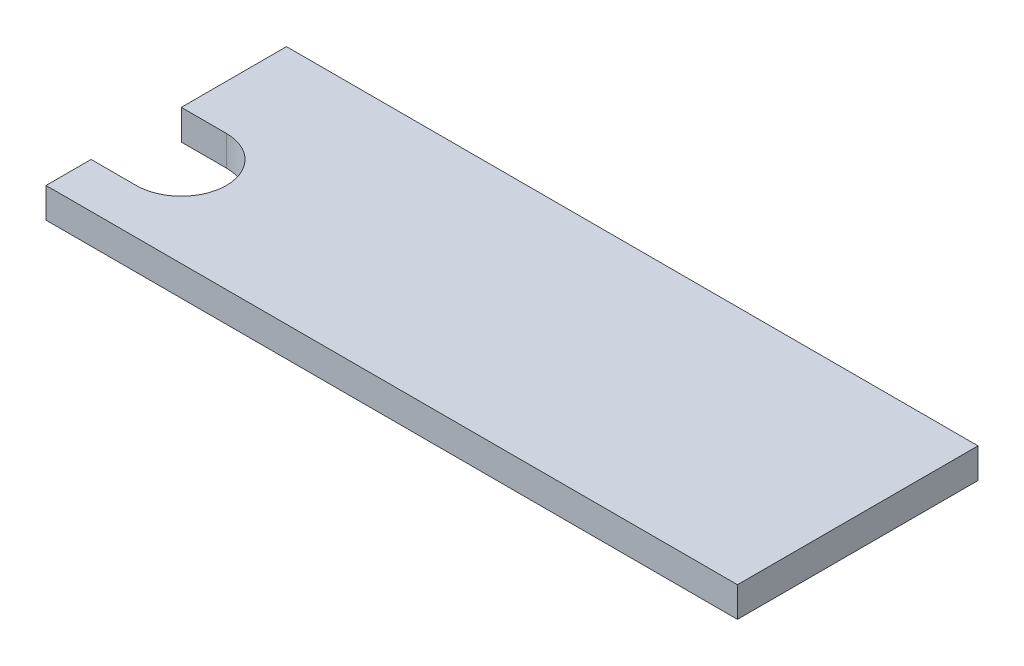
ISO-10303-21;
HEADER;
FILE_DESCRIPTION(('STEP AP214'),'2;1');
FILE_NAME('part.step','',(''),(''),'','','');
FILE_SCHEMA(('AUTOMOTIVE_DESIGN { 1 0 10303 214 1 1 1 1 }'));
ENDSEC;
DATA;
#1=APPLICATION_CONTEXT('core data for automotive mechanical design processes');
#2=APPLICATION_PROTOCOL_DEFINITION('international standard','automotive_design',2000,#1);
#3=PRODUCT_CONTEXT('',#1,'mechanical');
#4=PRODUCT('Part','Part','',(#3));
#5=PRODUCT_RELATED_PRODUCT_CATEGORY('part','',(#4));
#6=PRODUCT_DEFINITION_FORMATION('','',#4);
#7=PRODUCT_DEFINITION_CONTEXT('part definition',#1,'design');
#8=PRODUCT_DEFINITION('design','',#6,#7);
#9=PRODUCT_DEFINITION_SHAPE('','',#8);
#10=(LENGTH_UNIT() NAMED_UNIT(*) SI_UNIT(.MILLI.,.METRE.));
#11=(NAMED_UNIT(*) PLANE_ANGLE_UNIT() SI_UNIT($,.RADIAN.));
#12=(NAMED_UNIT(*) SI_UNIT($,.STERADIAN.) SOLID_ANGLE_UNIT());
#13=UNCERTAINTY_MEASURE_WITH_UNIT(LENGTH_MEASURE(1.E-05),#10,'distance_accuracy_value','');
#14=(GEOMETRIC_REPRESENTATION_CONTEXT(3) GLOBAL_UNCERTAINTY_ASSIGNED_CONTEXT((#13)) GLOBAL_UNIT_ASSIGNED_CONTEXT((#10,
#11,#12)) REPRESENTATION_CONTEXT('',''));
#15=CARTESIAN_POINT('',(0.,0.,0.));
#16=DIRECTION('',(0.,0.,1.));
#17=DIRECTION('',(1.,0.,0.));
#18=AXIS2_PLACEMENT_3D('',#15,#16,#17);
#19=CARTESIAN_POINT('',(-115.,0.,-3.88578058618805E-13));
#20=DIRECTION('',(-1.,0.,0.));
#21=DIRECTION('',(0.,0.,1.));
#22=AXIS2_PLACEMENT_3D('',#19,#20,#21);
#23=PLANE('',#22);
#24=DIRECTION('',(0.,1.,0.));
#25=VECTOR('',#24,1.);
#26=CARTESIAN_POINT('',(-115.,-5.00099999999959,-5.0000000000005));
#27=LINE('',#26,#25);
#28=CARTESIAN_POINT('',(-115.,-4.99999999999901,-5.0000000000005));
#29=VERTEX_POINT('',#28);
#30=CARTESIAN_POINT('',(-115.,5.00000000000039,-5.0000000000005));
#31=VERTEX_POINT('',#30);
#32=EDGE_CURVE('E111',#29,#31,#27,.T.);
#33=ORIENTED_EDGE('',*,*,#32,.T.);
#34=DIRECTION('',(0.,0.,1.));
#35=VECTOR('',#34,1.);
#36=CARTESIAN_POINT('',(-115.,5.00000000000039,-40.0000000000004));
#37=LINE('',#36,#35);
#38=CARTESIAN_POINT('',(-115.,5.00000000000039,-40.0000000000004));
#39=VERTEX_POINT('',#38);
#40=EDGE_CURVE('E134',#39,#31,#37,.T.);
#41=ORIENTED_EDGE('',*,*,#40,.F.);
#42=DIRECTION('',(0.,1.,0.));
#43=VECTOR('',#42,1.);
#44=CARTESIAN_POINT('',(-115.,5.00000000000039,-40.0000000000004));
#45=LINE('',#44,#43);
#46=CARTESIAN_POINT('',(-115.,-4.99999999999901,-40.0000000000004));
#47=VERTEX_POINT('',#46);
#48=EDGE_CURVE('E128',#47,#39,#45,.T.);
#49=ORIENTED_EDGE('',*,*,#48,.F.);
#50=DIRECTION('',(0.,0.,-1.));
#51=VECTOR('',#50,1.);
#52=CARTESIAN_POINT('',(-115.,-4.99999999999901,-40.0000000000004));
#53=LINE('',#52,#51);
#54=EDGE_CURVE('E82',#29,#47,#53,.T.);
#55=ORIENTED_EDGE('',*,*,#54,.F.);
#56=EDGE_LOOP('',(#33,#41,#49,#55));
#57=FACE_BOUND('',#56,.T.);
#58=ADVANCED_FACE('F36',(#57),#23,.T.);
#59=CARTESIAN_POINT('',(115.,5.00000000000034,-40.));
#60=DIRECTION('',(0.,0.,1.));
#61=DIRECTION('',(1.,0.,0.));
#62=AXIS2_PLACEMENT_3D('',#59,#60,#61);
#63=PLANE('',#62);
#64=ORIENTED_EDGE('',*,*,#48,.T.);
#65=DIRECTION('',(-1.,0.,0.));
#66=VECTOR('',#65,1.);
#67=CARTESIAN_POINT('',(115.,5.00000000000034,-40.));
#68=LINE('',#67,#66);
#69=CARTESIAN_POINT('',(115.,5.00000000000034,-40.));
#70=VERTEX_POINT('',#69);
#71=EDGE_CURVE('E12',#70,#39,#68,.T.);
#72=ORIENTED_EDGE('',*,*,#71,.F.);
#73=DIRECTION('',(0.,1.,0.));
#74=VECTOR('',#73,1.);
#75=CARTESIAN_POINT('',(115.,5.00000000000034,-40.));
#76=LINE('',#75,#74);
#77=CARTESIAN_POINT('',(115.,-4.99999999999939,-40.));
#78=VERTEX_POINT('',#77);
#79=EDGE_CURVE('E133',#78,#70,#76,.T.);
#80=ORIENTED_EDGE('',*,*,#79,.F.);
#81=DIRECTION('',(-1.,0.,0.));
#82=VECTOR('',#81,1.);
#83=CARTESIAN_POINT('',(115.,-4.99999999999939,-40.));
#84=LINE('',#83,#82);
#85=EDGE_CURVE('E138',#78,#47,#84,.T.);
#86=ORIENTED_EDGE('',*,*,#85,.T.);
#87=EDGE_LOOP('',(#64,#72,#80,#86));
#88=FACE_BOUND('',#87,.T.);
#89=ADVANCED_FACE('F38',(#88),#63,.F.);
#90=CARTESIAN_POINT('',(115.,5.00000000000034,-40.));
#91=DIRECTION('',(0.,-1.,0.));
#92=DIRECTION('',(0.,0.,-1.));
#93=AXIS2_PLACEMENT_3D('',#90,#91,#92);
#94=PLANE('',#93);
#95=ORIENTED_EDGE('',*,*,#40,.T.);
#96=DIRECTION('',(-1.,0.,0.));
#97=VECTOR('',#96,1.);
#98=CARTESIAN_POINT('',(-129.999999999999,5.00000000000167,-5.0000000000005));
#99=LINE('',#98,#97);
#100=CARTESIAN_POINT('',(-99.9999999999996,4.99999999999989,-5.0000000000005));
#101=VERTEX_POINT('',#100);
#102=EDGE_CURVE('E116',#101,#31,#99,.T.);
#103=ORIENTED_EDGE('',*,*,#102,.F.);
#104=CARTESIAN_POINT('',(-99.9999999999996,4.99999999999989,9.99999999999962));
#105=DIRECTION('',(0.,1.,0.));
#106=DIRECTION('',(0.,0.,1.));
#107=AXIS2_PLACEMENT_3D('',#104,#105,#106);
#108=CIRCLE('',#107,15.);
#109=CARTESIAN_POINT('',(-100.,5.00000000000034,24.9999999999995));
#110=VERTEX_POINT('',#109);
#111=EDGE_CURVE('E166',#110,#101,#108,.T.);
#112=ORIENTED_EDGE('',*,*,#111,.F.);
#113=DIRECTION('',(1.,0.,0.));
#114=VECTOR('',#113,1.);
#115=CARTESIAN_POINT('',(-129.999999999999,5.00000000000167,24.9999999999995));
#116=LINE('',#115,#114);
#117=CARTESIAN_POINT('',(-115.,5.00000000000078,24.9999999999995));
#118=VERTEX_POINT('',#117);
#119=EDGE_CURVE('E124',#118,#110,#116,.T.);
#120=ORIENTED_EDGE('',*,*,#119,.F.);
#121=CARTESIAN_POINT('',(-115.,5.00000000000078,39.9999999999996));
#122=VERTEX_POINT('',#121);
#123=EDGE_CURVE('E155',#118,#122,#37,.T.);
#124=ORIENTED_EDGE('',*,*,#123,.T.);
#125=DIRECTION('',(-1.,0.,0.));
#126=VECTOR('',#125,1.);
#127=CARTESIAN_POINT('',(115.,5.00000000000028,40.));
#128=LINE('',#127,#126);
#129=CARTESIAN_POINT('',(115.,5.00000000000028,40.));
#130=VERTEX_POINT('',#129);
#131=EDGE_CURVE('E45',#130,#122,#128,.T.);
#132=ORIENTED_EDGE('',*,*,#131,.F.);
#133=DIRECTION('',(0.,0.,1.));
#134=VECTOR('',#133,1.);
#135=CARTESIAN_POINT('',(115.,5.00000000000034,-40.));
#136=LINE('',#135,#134);
#137=EDGE_CURVE('E89',#70,#130,#136,.T.);
#138=ORIENTED_EDGE('',*,*,#137,.F.);
#139=ORIENTED_EDGE('',*,*,#71,.T.);
#140=EDGE_LOOP('',(#95,#103,#112,#120,#124,#132,#138,#139));
#141=FACE_BOUND('',#140,.T.);
#142=ADVANCED_FACE('F179',(#141),#94,.F.);
#143=CARTESIAN_POINT('',(115.,-4.99999999999945,40.));
#144=DIRECTION('',(0.,0.,-1.));
#145=DIRECTION('',(-1.,0.,0.));
#146=AXIS2_PLACEMENT_3D('',#143,#144,#145);
#147=PLANE('',#146);
#148=DIRECTION('',(0.,-1.,0.));
#149=VECTOR('',#148,1.);
#150=CARTESIAN_POINT('',(-115.,-4.99999999999851,39.9999999999996));
#151=LINE('',#150,#149);
#152=CARTESIAN_POINT('',(-115.,-4.99999999999851,39.9999999999996));
#153=VERTEX_POINT('',#152);
#154=EDGE_CURVE('E130',#122,#153,#151,.T.);
#155=ORIENTED_EDGE('',*,*,#154,.T.);
#156=DIRECTION('',(-1.,0.,0.));
#157=VECTOR('',#156,1.);
#158=CARTESIAN_POINT('',(115.,-4.99999999999945,40.));
#159=LINE('',#158,#157);
#160=CARTESIAN_POINT('',(115.,-4.99999999999945,40.));
#161=VERTEX_POINT('',#160);
#162=EDGE_CURVE('E140',#161,#153,#159,.T.);
#163=ORIENTED_EDGE('',*,*,#162,.F.);
#164=DIRECTION('',(0.,-1.,0.));
#165=VECTOR('',#164,1.);
#166=CARTESIAN_POINT('',(115.,-4.99999999999945,40.));
#167=LINE('',#166,#165);
#168=EDGE_CURVE('E151',#130,#161,#167,.T.);
#169=ORIENTED_EDGE('',*,*,#168,.F.);
#170=ORIENTED_EDGE('',*,*,#131,.T.);
#171=EDGE_LOOP('',(#155,#163,#169,#170));
#172=FACE_BOUND('',#171,.T.);
#173=ADVANCED_FACE('F193',(#172),#147,.F.);
#174=CARTESIAN_POINT('',(115.,-4.99999999999939,-40.));
#175=DIRECTION('',(0.,1.,0.));
#176=DIRECTION('',(0.,0.,1.));
#177=AXIS2_PLACEMENT_3D('',#174,#175,#176);
#178=PLANE('',#177);
#179=CARTESIAN_POINT('',(-100.,-4.99999999999989,9.99999999999962));
#180=DIRECTION('',(0.,1.,0.));
#181=DIRECTION('',(0.,0.,1.));
#182=AXIS2_PLACEMENT_3D('',#179,#180,#181);
#183=CIRCLE('',#182,15.);
#184=CARTESIAN_POINT('',(-100.,-4.99999999999989,-5.0000000000005));
#185=VERTEX_POINT('',#184);
#186=CARTESIAN_POINT('',(-100.,-4.99999999999989,24.9999999999995));
#187=VERTEX_POINT('',#186);
#188=EDGE_CURVE('E119',#185,#187,#183,.F.);
#189=ORIENTED_EDGE('',*,*,#188,.F.);
#190=DIRECTION('',(1.,0.,0.));
#191=VECTOR('',#190,1.);
#192=CARTESIAN_POINT('',(-130.,-4.99999999999989,-5.0000000000005));
#193=LINE('',#192,#191);
#194=EDGE_CURVE('E113',#29,#185,#193,.T.);
#195=ORIENTED_EDGE('',*,*,#194,.F.);
#196=ORIENTED_EDGE('',*,*,#54,.T.);
#197=ORIENTED_EDGE('',*,*,#85,.F.);
#198=DIRECTION('',(0.,0.,-1.));
#199=VECTOR('',#198,1.);
#200=CARTESIAN_POINT('',(115.,-4.99999999999939,-40.));
#201=LINE('',#200,#199);
#202=EDGE_CURVE('E61',#161,#78,#201,.T.);
#203=ORIENTED_EDGE('',*,*,#202,.F.);
#204=ORIENTED_EDGE('',*,*,#162,.T.);
#205=CARTESIAN_POINT('',(-115.,-4.99999999999895,24.9999999999995));
#206=VERTEX_POINT('',#205);
#207=EDGE_CURVE('E129',#153,#206,#53,.T.);
#208=ORIENTED_EDGE('',*,*,#207,.T.);
#209=DIRECTION('',(-1.,0.,0.));
#210=VECTOR('',#209,1.);
#211=CARTESIAN_POINT('',(-130.,-4.99999999999989,24.9999999999995));
#212=LINE('',#211,#210);
#213=EDGE_CURVE('E52',#187,#206,#212,.T.);
#214=ORIENTED_EDGE('',*,*,#213,.F.);
#215=EDGE_LOOP('',(#189,#195,#196,#197,#203,#204,#208,#214));
#216=FACE_BOUND('',#215,.T.);
#217=ADVANCED_FACE('F123',(#216),#178,.F.);
#218=CARTESIAN_POINT('',(115.,4.44089209850063E-13,0.));
#219=DIRECTION('',(-1.,0.,0.));
#220=DIRECTION('',(0.,0.,1.));
#221=AXIS2_PLACEMENT_3D('',#218,#219,#220);
#222=PLANE('',#221);
#223=ORIENTED_EDGE('',*,*,#79,.T.);
#224=ORIENTED_EDGE('',*,*,#137,.T.);
#225=ORIENTED_EDGE('',*,*,#168,.T.);
#226=ORIENTED_EDGE('',*,*,#202,.T.);
#227=EDGE_LOOP('',(#223,#224,#225,#226));
#228=FACE_BOUND('',#227,.T.);
#229=ADVANCED_FACE('F194',(#228),#222,.F.);
#230=DIRECTION('',(0.,-1.,0.));
#231=VECTOR('',#230,1.);
#232=CARTESIAN_POINT('',(-115.,-5.00099999999959,24.9999999999995));
#233=LINE('',#232,#231);
#234=EDGE_CURVE('E120',#118,#206,#233,.T.);
#235=ORIENTED_EDGE('',*,*,#234,.T.);
#236=ORIENTED_EDGE('',*,*,#207,.F.);
#237=ORIENTED_EDGE('',*,*,#154,.F.);
#238=ORIENTED_EDGE('',*,*,#123,.F.);
#239=EDGE_LOOP('',(#235,#236,#237,#238));
#240=FACE_BOUND('',#239,.T.);
#241=ADVANCED_FACE('F189',(#240),#23,.T.);
#242=CARTESIAN_POINT('',(-130.000000000001,-5.00099999999915,-5.0000000000005));
#243=DIRECTION('',(0.,0.,-1.));
#244=DIRECTION('',(-1.,0.,0.));
#245=AXIS2_PLACEMENT_3D('',#242,#243,#244);
#246=PLANE('',#245);
#247=ORIENTED_EDGE('',*,*,#194,.T.);
#248=DIRECTION('',(0.,1.,0.));
#249=VECTOR('',#248,1.);
#250=CARTESIAN_POINT('',(-99.9999999999996,-5.00100000000003,-5.0000000000005));
#251=LINE('',#250,#249);
#252=EDGE_CURVE('E169',#185,#101,#251,.T.);
#253=ORIENTED_EDGE('',*,*,#252,.T.);
#254=ORIENTED_EDGE('',*,*,#102,.T.);
#255=ORIENTED_EDGE('',*,*,#32,.F.);
#256=EDGE_LOOP('',(#247,#253,#254,#255));
#257=FACE_BOUND('',#256,.T.);
#258=ADVANCED_FACE('F112',(#257),#246,.F.);
#259=CARTESIAN_POINT('',(-99.9999999999996,-5.00100000000003,9.99999999999962));
#260=DIRECTION('',(0.,1.,0.));
#261=DIRECTION('',(0.,0.,1.));
#262=AXIS2_PLACEMENT_3D('',#259,#260,#261);
#263=CYLINDRICAL_SURFACE('',#262,15.);
#264=ORIENTED_EDGE('',*,*,#188,.T.);
#265=DIRECTION('',(0.,1.,0.));
#266=VECTOR('',#265,1.);
#267=CARTESIAN_POINT('',(-99.9999999999996,-5.00100000000003,24.9999999999995));
#268=LINE('',#267,#266);
#269=EDGE_CURVE('E165',#187,#110,#268,.T.);
#270=ORIENTED_EDGE('',*,*,#269,.T.);
#271=ORIENTED_EDGE('',*,*,#111,.T.);
#272=ORIENTED_EDGE('',*,*,#252,.F.);
#273=EDGE_LOOP('',(#264,#270,#271,#272));
#274=FACE_BOUND('',#273,.T.);
#275=ADVANCED_FACE('F174',(#274),#263,.F.);
#276=CARTESIAN_POINT('',(-130.000000000001,-5.00099999999915,24.9999999999995));
#277=DIRECTION('',(0.,0.,1.));
#278=DIRECTION('',(1.,0.,0.));
#279=AXIS2_PLACEMENT_3D('',#276,#277,#278);
#280=PLANE('',#279);
#281=ORIENTED_EDGE('',*,*,#213,.T.);
#282=ORIENTED_EDGE('',*,*,#234,.F.);
#283=ORIENTED_EDGE('',*,*,#119,.T.);
#284=ORIENTED_EDGE('',*,*,#269,.F.);
#285=EDGE_LOOP('',(#281,#282,#283,#284));
#286=FACE_BOUND('',#285,.T.);
#287=ADVANCED_FACE('F177',(#286),#280,.F.);
#288=CLOSED_SHELL('',(#58,#89,#142,#173,#217,#229,#241,#258,#275,#287));
#289=MANIFOLD_SOLID_BREP('B2',#288);
#290=ADVANCED_BREP_SHAPE_REPRESENTATION('',(#18,#289),#14);
#291=SHAPE_DEFINITION_REPRESENTATION(#9,#290);
ENDSEC;
END-ISO-10303-21;
